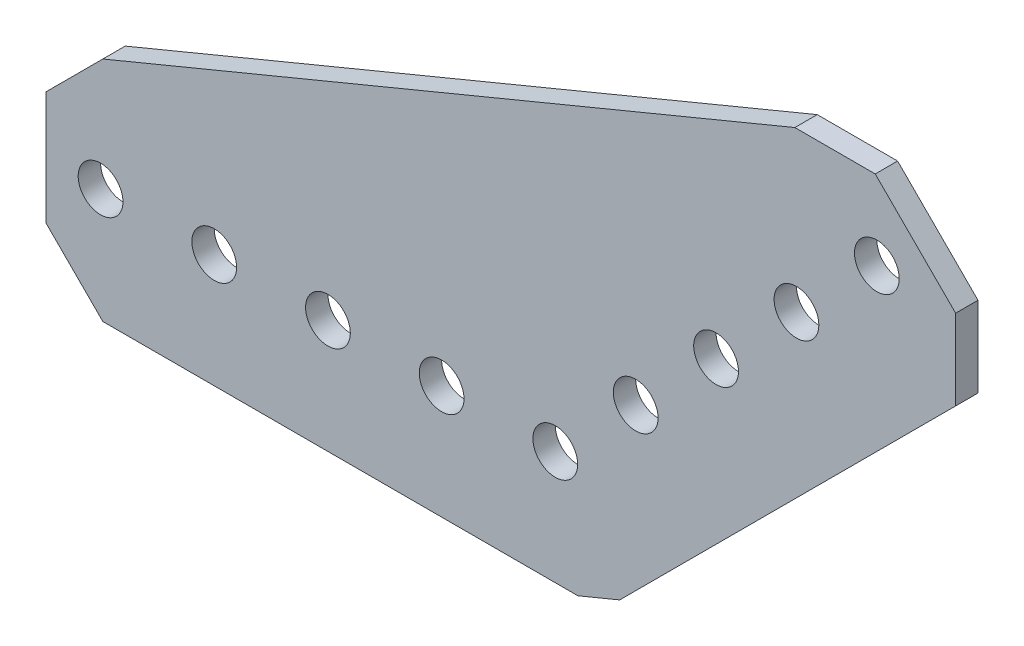
ISO-10303-21;
HEADER;
FILE_DESCRIPTION(('STEP AP214'),'2;1');
FILE_NAME('part.step','',(''),(''),'','','');
FILE_SCHEMA(('AUTOMOTIVE_DESIGN { 1 0 10303 214 1 1 1 1 }'));
ENDSEC;
DATA;
#1=APPLICATION_CONTEXT('core data for automotive mechanical design processes');
#2=APPLICATION_PROTOCOL_DEFINITION('international standard','automotive_design',2000,#1);
#3=PRODUCT_CONTEXT('',#1,'mechanical');
#4=PRODUCT('Part','Part','',(#3));
#5=PRODUCT_RELATED_PRODUCT_CATEGORY('part','',(#4));
#6=PRODUCT_DEFINITION_FORMATION('','',#4);
#7=PRODUCT_DEFINITION_CONTEXT('part definition',#1,'design');
#8=PRODUCT_DEFINITION('design','',#6,#7);
#9=PRODUCT_DEFINITION_SHAPE('','',#8);
#10=(LENGTH_UNIT() NAMED_UNIT(*) SI_UNIT(.MILLI.,.METRE.));
#11=(NAMED_UNIT(*) PLANE_ANGLE_UNIT() SI_UNIT($,.RADIAN.));
#12=(NAMED_UNIT(*) SI_UNIT($,.STERADIAN.) SOLID_ANGLE_UNIT());
#13=UNCERTAINTY_MEASURE_WITH_UNIT(LENGTH_MEASURE(1.E-05),#10,'distance_accuracy_value','');
#14=(GEOMETRIC_REPRESENTATION_CONTEXT(3) GLOBAL_UNCERTAINTY_ASSIGNED_CONTEXT((#13)) GLOBAL_UNIT_ASSIGNED_CONTEXT((#10,
#11,#12)) REPRESENTATION_CONTEXT('',''));
#15=CARTESIAN_POINT('',(0.,0.,0.));
#16=DIRECTION('',(0.,0.,1.));
#17=DIRECTION('',(1.,0.,0.));
#18=AXIS2_PLACEMENT_3D('',#15,#16,#17);
#19=CARTESIAN_POINT('',(-56.896,6.35,1.25));
#20=DIRECTION('',(-0.707106781186547,0.707106781186548,0.));
#21=DIRECTION('',(-0.707106781186548,-0.707106781186547,0.));
#22=AXIS2_PLACEMENT_3D('',#19,#20,#21);
#23=PLANE('',#22);
#24=DIRECTION('',(0.707106781186548,0.707106781186547,0.));
#25=VECTOR('',#24,1.);
#26=CARTESIAN_POINT('',(-56.896,6.35,-1.25));
#27=LINE('',#26,#25);
#28=CARTESIAN_POINT('',(-56.896,6.35,-1.25));
#29=VERTEX_POINT('',#28);
#30=CARTESIAN_POINT('',(-50.546,12.7,-1.25));
#31=VERTEX_POINT('',#30);
#32=EDGE_CURVE('E160',#29,#31,#27,.T.);
#33=ORIENTED_EDGE('',*,*,#32,.F.);
#34=DIRECTION('',(0.,0.,-1.));
#35=VECTOR('',#34,1.);
#36=CARTESIAN_POINT('',(-56.896,6.35,1.25));
#37=LINE('',#36,#35);
#38=CARTESIAN_POINT('',(-56.896,6.35,1.25));
#39=VERTEX_POINT('',#38);
#40=EDGE_CURVE('E11',#39,#29,#37,.T.);
#41=ORIENTED_EDGE('',*,*,#40,.F.);
#42=DIRECTION('',(0.707106781186548,0.707106781186547,0.));
#43=VECTOR('',#42,1.);
#44=CARTESIAN_POINT('',(-56.896,6.35,1.25));
#45=LINE('',#44,#43);
#46=CARTESIAN_POINT('',(-50.546,12.7,1.25));
#47=VERTEX_POINT('',#46);
#48=EDGE_CURVE('E197',#39,#47,#45,.T.);
#49=ORIENTED_EDGE('',*,*,#48,.T.);
#50=DIRECTION('',(0.,0.,-1.));
#51=VECTOR('',#50,1.);
#52=CARTESIAN_POINT('',(-50.546,12.7,1.25));
#53=LINE('',#52,#51);
#54=EDGE_CURVE('E48',#47,#31,#53,.T.);
#55=ORIENTED_EDGE('',*,*,#54,.T.);
#56=EDGE_LOOP('',(#33,#41,#49,#55));
#57=FACE_BOUND('',#56,.T.);
#58=ADVANCED_FACE('F45',(#57),#23,.T.);
#59=CARTESIAN_POINT('',(-56.896,-6.35,1.25));
#60=DIRECTION('',(-1.,0.,0.));
#61=DIRECTION('',(0.,0.,1.));
#62=AXIS2_PLACEMENT_3D('',#59,#60,#61);
#63=PLANE('',#62);
#64=DIRECTION('',(0.,1.,0.));
#65=VECTOR('',#64,1.);
#66=CARTESIAN_POINT('',(-56.896,-6.35,-1.25));
#67=LINE('',#66,#65);
#68=CARTESIAN_POINT('',(-56.896,-6.35,-1.25));
#69=VERTEX_POINT('',#68);
#70=EDGE_CURVE('E194',#69,#29,#67,.T.);
#71=ORIENTED_EDGE('',*,*,#70,.F.);
#72=DIRECTION('',(0.,0.,-1.));
#73=VECTOR('',#72,1.);
#74=CARTESIAN_POINT('',(-56.896,-6.35,1.25));
#75=LINE('',#74,#73);
#76=CARTESIAN_POINT('',(-56.896,-6.35,1.25));
#77=VERTEX_POINT('',#76);
#78=EDGE_CURVE('E55',#77,#69,#75,.T.);
#79=ORIENTED_EDGE('',*,*,#78,.F.);
#80=DIRECTION('',(0.,1.,0.));
#81=VECTOR('',#80,1.);
#82=CARTESIAN_POINT('',(-56.896,-6.35,1.25));
#83=LINE('',#82,#81);
#84=EDGE_CURVE('E146',#77,#39,#83,.T.);
#85=ORIENTED_EDGE('',*,*,#84,.T.);
#86=ORIENTED_EDGE('',*,*,#40,.T.);
#87=EDGE_LOOP('',(#71,#79,#85,#86));
#88=FACE_BOUND('',#87,.T.);
#89=ADVANCED_FACE('F221',(#88),#63,.T.);
#90=CARTESIAN_POINT('',(-50.546,-12.7,1.25));
#91=DIRECTION('',(-0.707106781186547,-0.707106781186548,0.));
#92=DIRECTION('',(0.707106781186548,-0.707106781186547,0.));
#93=AXIS2_PLACEMENT_3D('',#90,#91,#92);
#94=PLANE('',#93);
#95=DIRECTION('',(-0.707106781186548,0.707106781186547,0.));
#96=VECTOR('',#95,1.);
#97=CARTESIAN_POINT('',(-50.546,-12.7,-1.25));
#98=LINE('',#97,#96);
#99=CARTESIAN_POINT('',(-50.546,-12.7,-1.25));
#100=VERTEX_POINT('',#99);
#101=EDGE_CURVE('E132',#100,#69,#98,.T.);
#102=ORIENTED_EDGE('',*,*,#101,.F.);
#103=DIRECTION('',(0.,0.,-1.));
#104=VECTOR('',#103,1.);
#105=CARTESIAN_POINT('',(-50.546,-12.7,1.25));
#106=LINE('',#105,#104);
#107=CARTESIAN_POINT('',(-50.546,-12.7,1.25));
#108=VERTEX_POINT('',#107);
#109=EDGE_CURVE('E127',#108,#100,#106,.T.);
#110=ORIENTED_EDGE('',*,*,#109,.F.);
#111=DIRECTION('',(-0.707106781186548,0.707106781186547,0.));
#112=VECTOR('',#111,1.);
#113=CARTESIAN_POINT('',(-50.546,-12.7,1.25));
#114=LINE('',#113,#112);
#115=EDGE_CURVE('E130',#108,#77,#114,.T.);
#116=ORIENTED_EDGE('',*,*,#115,.T.);
#117=ORIENTED_EDGE('',*,*,#78,.T.);
#118=EDGE_LOOP('',(#102,#110,#116,#117));
#119=FACE_BOUND('',#118,.T.);
#120=ADVANCED_FACE('F129',(#119),#94,.T.);
#121=CARTESIAN_POINT('',(2.52618706572165,-12.7,1.25));
#122=DIRECTION('',(0.,-1.,0.));
#123=DIRECTION('',(0.,0.,-1.));
#124=AXIS2_PLACEMENT_3D('',#121,#122,#123);
#125=PLANE('',#124);
#126=DIRECTION('',(-1.,0.,0.));
#127=VECTOR('',#126,1.);
#128=CARTESIAN_POINT('',(2.52618706572165,-12.7,-1.25));
#129=LINE('',#128,#127);
#130=CARTESIAN_POINT('',(2.52618706572165,-12.7,-1.25));
#131=VERTEX_POINT('',#130);
#132=EDGE_CURVE('E189',#131,#100,#129,.T.);
#133=ORIENTED_EDGE('',*,*,#132,.F.);
#134=DIRECTION('',(0.,0.,-1.));
#135=VECTOR('',#134,1.);
#136=CARTESIAN_POINT('',(2.52618706572165,-12.7,1.25));
#137=LINE('',#136,#135);
#138=CARTESIAN_POINT('',(2.52618706572165,-12.7,1.25));
#139=VERTEX_POINT('',#138);
#140=EDGE_CURVE('E138',#139,#131,#137,.T.);
#141=ORIENTED_EDGE('',*,*,#140,.F.);
#142=DIRECTION('',(-1.,0.,0.));
#143=VECTOR('',#142,1.);
#144=CARTESIAN_POINT('',(2.52618706572165,-12.7,1.25));
#145=LINE('',#144,#143);
#146=EDGE_CURVE('E144',#139,#108,#145,.T.);
#147=ORIENTED_EDGE('',*,*,#146,.T.);
#148=ORIENTED_EDGE('',*,*,#109,.T.);
#149=EDGE_LOOP('',(#133,#141,#147,#148));
#150=FACE_BOUND('',#149,.T.);
#151=ADVANCED_FACE('F149',(#150),#125,.T.);
#152=CARTESIAN_POINT('',(7.19397211635163,-10.7665401257867,1.25));
#153=DIRECTION('',(0.38268343236509,-0.923879532511287,0.));
#154=DIRECTION('',(0.923879532511287,0.38268343236509,0.));
#155=AXIS2_PLACEMENT_3D('',#152,#153,#154);
#156=PLANE('',#155);
#157=DIRECTION('',(-0.923879532511287,-0.38268343236509,0.));
#158=VECTOR('',#157,1.);
#159=CARTESIAN_POINT('',(7.19397211635163,-10.7665401257867,-1.25));
#160=LINE('',#159,#158);
#161=CARTESIAN_POINT('',(7.19397211635163,-10.7665401257867,-1.25));
#162=VERTEX_POINT('',#161);
#163=EDGE_CURVE('E185',#162,#131,#160,.T.);
#164=ORIENTED_EDGE('',*,*,#163,.F.);
#165=DIRECTION('',(0.,0.,-1.));
#166=VECTOR('',#165,1.);
#167=CARTESIAN_POINT('',(7.19397211635163,-10.7665401257867,1.25));
#168=LINE('',#167,#166);
#169=CARTESIAN_POINT('',(7.19397211635163,-10.7665401257867,1.25));
#170=VERTEX_POINT('',#169);
#171=EDGE_CURVE('E203',#170,#162,#168,.T.);
#172=ORIENTED_EDGE('',*,*,#171,.F.);
#173=DIRECTION('',(-0.923879532511287,-0.38268343236509,0.));
#174=VECTOR('',#173,1.);
#175=CARTESIAN_POINT('',(7.19397211635163,-10.7665401257867,1.25));
#176=LINE('',#175,#174);
#177=EDGE_CURVE('E151',#170,#139,#176,.T.);
#178=ORIENTED_EDGE('',*,*,#177,.T.);
#179=ORIENTED_EDGE('',*,*,#140,.T.);
#180=EDGE_LOOP('',(#164,#172,#178,#179));
#181=FACE_BOUND('',#180,.T.);
#182=ADVANCED_FACE('F234',(#181),#156,.T.);
#183=CARTESIAN_POINT('',(44.7216754829243,26.7611632407862,1.25));
#184=DIRECTION('',(0.707106781186549,-0.707106781186546,0.));
#185=DIRECTION('',(0.707106781186546,0.707106781186549,0.));
#186=AXIS2_PLACEMENT_3D('',#183,#184,#185);
#187=PLANE('',#186);
#188=DIRECTION('',(-0.707106781186546,-0.707106781186549,0.));
#189=VECTOR('',#188,1.);
#190=CARTESIAN_POINT('',(44.7216754829243,26.7611632407862,-1.25));
#191=LINE('',#190,#189);
#192=CARTESIAN_POINT('',(44.7216754829243,26.7611632407862,-1.25));
#193=VERTEX_POINT('',#192);
#194=EDGE_CURVE('E181',#193,#162,#191,.T.);
#195=ORIENTED_EDGE('',*,*,#194,.F.);
#196=DIRECTION('',(0.,0.,-1.));
#197=VECTOR('',#196,1.);
#198=CARTESIAN_POINT('',(44.7216754829243,26.7611632407862,1.25));
#199=LINE('',#198,#197);
#200=CARTESIAN_POINT('',(44.7216754829243,26.7611632407862,1.25));
#201=VERTEX_POINT('',#200);
#202=EDGE_CURVE('E206',#201,#193,#199,.T.);
#203=ORIENTED_EDGE('',*,*,#202,.F.);
#204=DIRECTION('',(-0.707106781186546,-0.707106781186549,0.));
#205=VECTOR('',#204,1.);
#206=CARTESIAN_POINT('',(44.7216754829243,26.7611632407862,1.25));
#207=LINE('',#206,#205);
#208=EDGE_CURVE('E154',#201,#170,#207,.T.);
#209=ORIENTED_EDGE('',*,*,#208,.T.);
#210=ORIENTED_EDGE('',*,*,#171,.T.);
#211=EDGE_LOOP('',(#195,#203,#209,#210));
#212=FACE_BOUND('',#211,.T.);
#213=ADVANCED_FACE('F237',(#212),#187,.T.);
#214=CARTESIAN_POINT('',(44.7216754829243,35.7414193618553,1.25));
#215=DIRECTION('',(1.,0.,0.));
#216=DIRECTION('',(0.,1.,0.));
#217=AXIS2_PLACEMENT_3D('',#214,#215,#216);
#218=PLANE('',#217);
#219=DIRECTION('',(0.,-1.,0.));
#220=VECTOR('',#219,1.);
#221=CARTESIAN_POINT('',(44.7216754829243,35.7414193618553,-1.25));
#222=LINE('',#221,#220);
#223=CARTESIAN_POINT('',(44.7216754829243,35.7414193618553,-1.25));
#224=VERTEX_POINT('',#223);
#225=EDGE_CURVE('E177',#224,#193,#222,.T.);
#226=ORIENTED_EDGE('',*,*,#225,.F.);
#227=DIRECTION('',(0.,0.,-1.));
#228=VECTOR('',#227,1.);
#229=CARTESIAN_POINT('',(44.7216754829243,35.7414193618553,1.25));
#230=LINE('',#229,#228);
#231=CARTESIAN_POINT('',(44.7216754829243,35.7414193618553,1.25));
#232=VERTEX_POINT('',#231);
#233=EDGE_CURVE('E209',#232,#224,#230,.T.);
#234=ORIENTED_EDGE('',*,*,#233,.F.);
#235=DIRECTION('',(0.,-1.,0.));
#236=VECTOR('',#235,1.);
#237=CARTESIAN_POINT('',(44.7216754829243,35.7414193618553,1.25));
#238=LINE('',#237,#236);
#239=EDGE_CURVE('E389',#232,#201,#238,.T.);
#240=ORIENTED_EDGE('',*,*,#239,.T.);
#241=ORIENTED_EDGE('',*,*,#202,.T.);
#242=EDGE_LOOP('',(#226,#234,#240,#241));
#243=FACE_BOUND('',#242,.T.);
#244=ADVANCED_FACE('F241',(#243),#218,.T.);
#245=CARTESIAN_POINT('',(35.7414193618552,44.7216754829245,1.25));
#246=DIRECTION('',(0.70710678118655,0.707106781186545,0.));
#247=DIRECTION('',(-0.707106781186545,0.70710678118655,0.));
#248=AXIS2_PLACEMENT_3D('',#245,#246,#247);
#249=PLANE('',#248);
#250=DIRECTION('',(0.707106781186545,-0.70710678118655,0.));
#251=VECTOR('',#250,1.);
#252=CARTESIAN_POINT('',(35.7414193618552,44.7216754829245,-1.25));
#253=LINE('',#252,#251);
#254=CARTESIAN_POINT('',(35.7414193618552,44.7216754829245,-1.25));
#255=VERTEX_POINT('',#254);
#256=EDGE_CURVE('E173',#255,#224,#253,.T.);
#257=ORIENTED_EDGE('',*,*,#256,.F.);
#258=DIRECTION('',(0.,0.,-1.));
#259=VECTOR('',#258,1.);
#260=CARTESIAN_POINT('',(35.7414193618552,44.7216754829245,1.25));
#261=LINE('',#260,#259);
#262=CARTESIAN_POINT('',(35.7414193618552,44.7216754829245,1.25));
#263=VERTEX_POINT('',#262);
#264=EDGE_CURVE('E212',#263,#255,#261,.T.);
#265=ORIENTED_EDGE('',*,*,#264,.F.);
#266=DIRECTION('',(0.707106781186545,-0.70710678118655,0.));
#267=VECTOR('',#266,1.);
#268=CARTESIAN_POINT('',(35.7414193618552,44.7216754829245,1.25));
#269=LINE('',#268,#267);
#270=EDGE_CURVE('E385',#263,#232,#269,.T.);
#271=ORIENTED_EDGE('',*,*,#270,.T.);
#272=ORIENTED_EDGE('',*,*,#233,.T.);
#273=EDGE_LOOP('',(#257,#265,#271,#272));
#274=FACE_BOUND('',#273,.T.);
#275=ADVANCED_FACE('F245',(#274),#249,.T.);
#276=CARTESIAN_POINT('',(26.7611632407861,44.7216754829245,1.25));
#277=DIRECTION('',(0.,1.,0.));
#278=DIRECTION('',(0.,0.,1.));
#279=AXIS2_PLACEMENT_3D('',#276,#277,#278);
#280=PLANE('',#279);
#281=DIRECTION('',(1.,0.,0.));
#282=VECTOR('',#281,1.);
#283=CARTESIAN_POINT('',(26.7611632407861,44.7216754829245,-1.25));
#284=LINE('',#283,#282);
#285=CARTESIAN_POINT('',(26.7611632407861,44.7216754829245,-1.25));
#286=VERTEX_POINT('',#285);
#287=EDGE_CURVE('E169',#286,#255,#284,.T.);
#288=ORIENTED_EDGE('',*,*,#287,.F.);
#289=DIRECTION('',(0.,0.,-1.));
#290=VECTOR('',#289,1.);
#291=CARTESIAN_POINT('',(26.7611632407861,44.7216754829245,1.25));
#292=LINE('',#291,#290);
#293=CARTESIAN_POINT('',(26.7611632407861,44.7216754829245,1.25));
#294=VERTEX_POINT('',#293);
#295=EDGE_CURVE('E214',#294,#286,#292,.T.);
#296=ORIENTED_EDGE('',*,*,#295,.F.);
#297=DIRECTION('',(1.,0.,0.));
#298=VECTOR('',#297,1.);
#299=CARTESIAN_POINT('',(26.7611632407861,44.7216754829245,1.25));
#300=LINE('',#299,#298);
#301=EDGE_CURVE('E381',#294,#263,#300,.T.);
#302=ORIENTED_EDGE('',*,*,#301,.T.);
#303=ORIENTED_EDGE('',*,*,#264,.T.);
#304=EDGE_LOOP('',(#288,#296,#302,#303));
#305=FACE_BOUND('',#304,.T.);
#306=ADVANCED_FACE('F249',(#305),#280,.T.);
#307=CARTESIAN_POINT('',(-50.546,12.7,1.25));
#308=DIRECTION('',(-0.382683432365091,0.923879532511287,0.));
#309=DIRECTION('',(-0.923879532511287,-0.382683432365091,0.));
#310=AXIS2_PLACEMENT_3D('',#307,#308,#309);
#311=PLANE('',#310);
#312=DIRECTION('',(0.923879532511287,0.382683432365091,0.));
#313=VECTOR('',#312,1.);
#314=CARTESIAN_POINT('',(-50.546,12.7,-1.25));
#315=LINE('',#314,#313);
#316=EDGE_CURVE('E164',#31,#286,#315,.T.);
#317=ORIENTED_EDGE('',*,*,#316,.F.);
#318=ORIENTED_EDGE('',*,*,#54,.F.);
#319=DIRECTION('',(0.923879532511287,0.382683432365091,0.));
#320=VECTOR('',#319,1.);
#321=CARTESIAN_POINT('',(-50.546,12.7,1.25));
#322=LINE('',#321,#320);
#323=EDGE_CURVE('E378',#47,#294,#322,.T.);
#324=ORIENTED_EDGE('',*,*,#323,.T.);
#325=ORIENTED_EDGE('',*,*,#295,.T.);
#326=EDGE_LOOP('',(#317,#318,#324,#325));
#327=FACE_BOUND('',#326,.T.);
#328=ADVANCED_FACE('F218',(#327),#311,.T.);
#329=CARTESIAN_POINT('',(0.,0.,1.25));
#330=DIRECTION('',(0.,0.,-1.));
#331=DIRECTION('',(-1.,0.,0.));
#332=AXIS2_PLACEMENT_3D('',#329,#330,#331);
#333=PLANE('',#332);
#334=CARTESIAN_POINT('',(8.9802561210692,8.98025612106911,1.25));
#335=DIRECTION('',(0.,0.,-1.));
#336=DIRECTION('',(1.,0.,0.));
#337=AXIS2_PLACEMENT_3D('',#334,#335,#336);
#338=CIRCLE('',#337,2.5);
#339=CARTESIAN_POINT('',(11.4802561210692,8.98025612106911,1.25));
#340=VERTEX_POINT('',#339);
#341=EDGE_CURVE('E304',#340,#340,#338,.T.);
#342=ORIENTED_EDGE('',*,*,#341,.T.);
#343=EDGE_LOOP('',(#342));
#344=FACE_BOUND('',#343,.T.);
#345=CARTESIAN_POINT('',(17.9605122421383,17.9605122421383,1.25));
#346=DIRECTION('',(0.,0.,-1.));
#347=DIRECTION('',(1.,0.,0.));
#348=AXIS2_PLACEMENT_3D('',#345,#346,#347);
#349=CIRCLE('',#348,2.5);
#350=CARTESIAN_POINT('',(20.4605122421383,17.9605122421383,1.25));
#351=VERTEX_POINT('',#350);
#352=EDGE_CURVE('E314',#351,#351,#349,.T.);
#353=ORIENTED_EDGE('',*,*,#352,.T.);
#354=EDGE_LOOP('',(#353));
#355=FACE_BOUND('',#354,.T.);
#356=CARTESIAN_POINT('',(26.9407683632075,26.9407683632075,1.25));
#357=DIRECTION('',(0.,0.,-1.));
#358=DIRECTION('',(1.,0.,0.));
#359=AXIS2_PLACEMENT_3D('',#356,#357,#358);
#360=CIRCLE('',#359,2.5);
#361=CARTESIAN_POINT('',(29.4407683632075,26.9407683632075,1.25));
#362=VERTEX_POINT('',#361);
#363=EDGE_CURVE('E322',#362,#362,#360,.T.);
#364=ORIENTED_EDGE('',*,*,#363,.T.);
#365=EDGE_LOOP('',(#364));
#366=FACE_BOUND('',#365,.T.);
#367=CARTESIAN_POINT('',(35.9210244842766,35.9210244842766,1.25));
#368=DIRECTION('',(0.,0.,-1.));
#369=DIRECTION('',(1.,0.,0.));
#370=AXIS2_PLACEMENT_3D('',#367,#368,#369);
#371=CIRCLE('',#370,2.5);
#372=CARTESIAN_POINT('',(38.4210244842766,35.9210244842766,1.25));
#373=VERTEX_POINT('',#372);
#374=EDGE_CURVE('E330',#373,#373,#371,.T.);
#375=ORIENTED_EDGE('',*,*,#374,.T.);
#376=EDGE_LOOP('',(#375));
#377=FACE_BOUND('',#376,.T.);
#378=CARTESIAN_POINT('',(-38.1,0.,1.25));
#379=DIRECTION('',(0.,0.,-1.));
#380=DIRECTION('',(1.,0.,0.));
#381=AXIS2_PLACEMENT_3D('',#378,#379,#380);
#382=CIRCLE('',#381,2.5);
#383=CARTESIAN_POINT('',(-35.6,0.,1.25));
#384=VERTEX_POINT('',#383);
#385=EDGE_CURVE('E338',#384,#384,#382,.T.);
#386=ORIENTED_EDGE('',*,*,#385,.T.);
#387=EDGE_LOOP('',(#386));
#388=FACE_BOUND('',#387,.T.);
#389=CARTESIAN_POINT('',(-50.8,0.,1.25));
#390=DIRECTION('',(0.,0.,-1.));
#391=DIRECTION('',(1.,0.,0.));
#392=AXIS2_PLACEMENT_3D('',#389,#390,#391);
#393=CIRCLE('',#392,2.5);
#394=CARTESIAN_POINT('',(-48.3,0.,1.25));
#395=VERTEX_POINT('',#394);
#396=EDGE_CURVE('E346',#395,#395,#393,.T.);
#397=ORIENTED_EDGE('',*,*,#396,.T.);
#398=EDGE_LOOP('',(#397));
#399=FACE_BOUND('',#398,.T.);
#400=CARTESIAN_POINT('',(0.,0.,1.25));
#401=DIRECTION('',(0.,0.,-1.));
#402=DIRECTION('',(1.,0.,0.));
#403=AXIS2_PLACEMENT_3D('',#400,#401,#402);
#404=CIRCLE('',#403,2.5);
#405=CARTESIAN_POINT('',(2.5,0.,1.25));
#406=VERTEX_POINT('',#405);
#407=EDGE_CURVE('E354',#406,#406,#404,.T.);
#408=ORIENTED_EDGE('',*,*,#407,.T.);
#409=EDGE_LOOP('',(#408));
#410=FACE_BOUND('',#409,.T.);
#411=CARTESIAN_POINT('',(-25.4,0.,1.25));
#412=DIRECTION('',(0.,0.,-1.));
#413=DIRECTION('',(1.,0.,0.));
#414=AXIS2_PLACEMENT_3D('',#411,#412,#413);
#415=CIRCLE('',#414,2.5);
#416=CARTESIAN_POINT('',(-22.9,0.,1.25));
#417=VERTEX_POINT('',#416);
#418=EDGE_CURVE('E362',#417,#417,#415,.T.);
#419=ORIENTED_EDGE('',*,*,#418,.T.);
#420=EDGE_LOOP('',(#419));
#421=FACE_BOUND('',#420,.T.);
#422=CARTESIAN_POINT('',(-12.7,0.,1.25));
#423=DIRECTION('',(0.,0.,-1.));
#424=DIRECTION('',(1.,0.,0.));
#425=AXIS2_PLACEMENT_3D('',#422,#423,#424);
#426=CIRCLE('',#425,2.5);
#427=CARTESIAN_POINT('',(-10.2,0.,1.25));
#428=VERTEX_POINT('',#427);
#429=EDGE_CURVE('E165',#428,#428,#426,.T.);
#430=ORIENTED_EDGE('',*,*,#429,.T.);
#431=EDGE_LOOP('',(#430));
#432=FACE_BOUND('',#431,.T.);
#433=ORIENTED_EDGE('',*,*,#48,.F.);
#434=ORIENTED_EDGE('',*,*,#84,.F.);
#435=ORIENTED_EDGE('',*,*,#115,.F.);
#436=ORIENTED_EDGE('',*,*,#146,.F.);
#437=ORIENTED_EDGE('',*,*,#177,.F.);
#438=ORIENTED_EDGE('',*,*,#208,.F.);
#439=ORIENTED_EDGE('',*,*,#239,.F.);
#440=ORIENTED_EDGE('',*,*,#270,.F.);
#441=ORIENTED_EDGE('',*,*,#301,.F.);
#442=ORIENTED_EDGE('',*,*,#323,.F.);
#443=EDGE_LOOP('',(#433,#434,#435,#436,#437,#438,#439,#440,#441,#442));
#444=FACE_BOUND('',#443,.T.);
#445=ADVANCED_FACE('F142',(#344,#355,#366,#377,#388,#399,#410,#421,#432,#444),#333,.F.);
#446=CARTESIAN_POINT('',(0.,0.,-1.25));
#447=DIRECTION('',(0.,0.,-1.));
#448=DIRECTION('',(-1.,0.,0.));
#449=AXIS2_PLACEMENT_3D('',#446,#447,#448);
#450=PLANE('',#449);
#451=CARTESIAN_POINT('',(8.9802561210692,8.98025612106911,-1.25));
#452=DIRECTION('',(0.,0.,-1.));
#453=DIRECTION('',(1.,0.,0.));
#454=AXIS2_PLACEMENT_3D('',#451,#452,#453);
#455=CIRCLE('',#454,2.5);
#456=CARTESIAN_POINT('',(11.4802561210692,8.98025612106911,-1.25));
#457=VERTEX_POINT('',#456);
#458=EDGE_CURVE('E307',#457,#457,#455,.T.);
#459=ORIENTED_EDGE('',*,*,#458,.F.);
#460=EDGE_LOOP('',(#459));
#461=FACE_BOUND('',#460,.T.);
#462=CARTESIAN_POINT('',(17.9605122421383,17.9605122421383,-1.25));
#463=DIRECTION('',(0.,0.,-1.));
#464=DIRECTION('',(1.,0.,0.));
#465=AXIS2_PLACEMENT_3D('',#462,#463,#464);
#466=CIRCLE('',#465,2.5);
#467=CARTESIAN_POINT('',(20.4605122421383,17.9605122421383,-1.25));
#468=VERTEX_POINT('',#467);
#469=EDGE_CURVE('E311',#468,#468,#466,.T.);
#470=ORIENTED_EDGE('',*,*,#469,.F.);
#471=EDGE_LOOP('',(#470));
#472=FACE_BOUND('',#471,.T.);
#473=CARTESIAN_POINT('',(26.9407683632075,26.9407683632075,-1.25));
#474=DIRECTION('',(0.,0.,-1.));
#475=DIRECTION('',(1.,0.,0.));
#476=AXIS2_PLACEMENT_3D('',#473,#474,#475);
#477=CIRCLE('',#476,2.5);
#478=CARTESIAN_POINT('',(29.4407683632075,26.9407683632075,-1.25));
#479=VERTEX_POINT('',#478);
#480=EDGE_CURVE('E318',#479,#479,#477,.T.);
#481=ORIENTED_EDGE('',*,*,#480,.F.);
#482=EDGE_LOOP('',(#481));
#483=FACE_BOUND('',#482,.T.);
#484=CARTESIAN_POINT('',(35.9210244842766,35.9210244842766,-1.25));
#485=DIRECTION('',(0.,0.,-1.));
#486=DIRECTION('',(1.,0.,0.));
#487=AXIS2_PLACEMENT_3D('',#484,#485,#486);
#488=CIRCLE('',#487,2.5);
#489=CARTESIAN_POINT('',(38.4210244842766,35.9210244842766,-1.25));
#490=VERTEX_POINT('',#489);
#491=EDGE_CURVE('E326',#490,#490,#488,.T.);
#492=ORIENTED_EDGE('',*,*,#491,.F.);
#493=EDGE_LOOP('',(#492));
#494=FACE_BOUND('',#493,.T.);
#495=CARTESIAN_POINT('',(-38.1,0.,-1.25));
#496=DIRECTION('',(0.,0.,-1.));
#497=DIRECTION('',(1.,0.,0.));
#498=AXIS2_PLACEMENT_3D('',#495,#496,#497);
#499=CIRCLE('',#498,2.5);
#500=CARTESIAN_POINT('',(-35.6,0.,-1.25));
#501=VERTEX_POINT('',#500);
#502=EDGE_CURVE('E334',#501,#501,#499,.T.);
#503=ORIENTED_EDGE('',*,*,#502,.F.);
#504=EDGE_LOOP('',(#503));
#505=FACE_BOUND('',#504,.T.);
#506=CARTESIAN_POINT('',(-50.8,0.,-1.25));
#507=DIRECTION('',(0.,0.,-1.));
#508=DIRECTION('',(1.,0.,0.));
#509=AXIS2_PLACEMENT_3D('',#506,#507,#508);
#510=CIRCLE('',#509,2.5);
#511=CARTESIAN_POINT('',(-48.3,0.,-1.25));
#512=VERTEX_POINT('',#511);
#513=EDGE_CURVE('E342',#512,#512,#510,.T.);
#514=ORIENTED_EDGE('',*,*,#513,.F.);
#515=EDGE_LOOP('',(#514));
#516=FACE_BOUND('',#515,.T.);
#517=CARTESIAN_POINT('',(0.,0.,-1.25));
#518=DIRECTION('',(0.,0.,-1.));
#519=DIRECTION('',(1.,0.,0.));
#520=AXIS2_PLACEMENT_3D('',#517,#518,#519);
#521=CIRCLE('',#520,2.5);
#522=CARTESIAN_POINT('',(2.5,0.,-1.25));
#523=VERTEX_POINT('',#522);
#524=EDGE_CURVE('E350',#523,#523,#521,.T.);
#525=ORIENTED_EDGE('',*,*,#524,.F.);
#526=EDGE_LOOP('',(#525));
#527=FACE_BOUND('',#526,.T.);
#528=CARTESIAN_POINT('',(-25.4,0.,-1.25));
#529=DIRECTION('',(0.,0.,-1.));
#530=DIRECTION('',(1.,0.,0.));
#531=AXIS2_PLACEMENT_3D('',#528,#529,#530);
#532=CIRCLE('',#531,2.5);
#533=CARTESIAN_POINT('',(-22.9,0.,-1.25));
#534=VERTEX_POINT('',#533);
#535=EDGE_CURVE('E358',#534,#534,#532,.T.);
#536=ORIENTED_EDGE('',*,*,#535,.F.);
#537=EDGE_LOOP('',(#536));
#538=FACE_BOUND('',#537,.T.);
#539=CARTESIAN_POINT('',(-12.7,0.,-1.25));
#540=DIRECTION('',(0.,0.,-1.));
#541=DIRECTION('',(1.,0.,0.));
#542=AXIS2_PLACEMENT_3D('',#539,#540,#541);
#543=CIRCLE('',#542,2.5);
#544=CARTESIAN_POINT('',(-10.2,0.,-1.25));
#545=VERTEX_POINT('',#544);
#546=EDGE_CURVE('E366',#545,#545,#543,.T.);
#547=ORIENTED_EDGE('',*,*,#546,.F.);
#548=EDGE_LOOP('',(#547));
#549=FACE_BOUND('',#548,.T.);
#550=ORIENTED_EDGE('',*,*,#32,.T.);
#551=ORIENTED_EDGE('',*,*,#316,.T.);
#552=ORIENTED_EDGE('',*,*,#287,.T.);
#553=ORIENTED_EDGE('',*,*,#256,.T.);
#554=ORIENTED_EDGE('',*,*,#225,.T.);
#555=ORIENTED_EDGE('',*,*,#194,.T.);
#556=ORIENTED_EDGE('',*,*,#163,.T.);
#557=ORIENTED_EDGE('',*,*,#132,.T.);
#558=ORIENTED_EDGE('',*,*,#101,.T.);
#559=ORIENTED_EDGE('',*,*,#70,.T.);
#560=EDGE_LOOP('',(#550,#551,#552,#553,#554,#555,#556,#557,#558,#559));
#561=FACE_BOUND('',#560,.T.);
#562=ADVANCED_FACE('F220',(#461,#472,#483,#494,#505,#516,#527,#538,#549,#561),#450,.T.);
#563=CARTESIAN_POINT('',(-12.7,0.,1.25));
#564=DIRECTION('',(0.,0.,-1.));
#565=DIRECTION('',(-1.,0.,0.));
#566=AXIS2_PLACEMENT_3D('',#563,#564,#565);
#567=CYLINDRICAL_SURFACE('',#566,2.5);
#568=ORIENTED_EDGE('',*,*,#429,.F.);
#569=EDGE_LOOP('',(#568));
#570=FACE_BOUND('',#569,.T.);
#571=ORIENTED_EDGE('',*,*,#546,.T.);
#572=EDGE_LOOP('',(#571));
#573=FACE_BOUND('',#572,.T.);
#574=ADVANCED_FACE('F261',(#570,#573),#567,.F.);
#575=CARTESIAN_POINT('',(-25.4,0.,1.25));
#576=DIRECTION('',(0.,0.,-1.));
#577=DIRECTION('',(-1.,0.,0.));
#578=AXIS2_PLACEMENT_3D('',#575,#576,#577);
#579=CYLINDRICAL_SURFACE('',#578,2.5);
#580=ORIENTED_EDGE('',*,*,#418,.F.);
#581=EDGE_LOOP('',(#580));
#582=FACE_BOUND('',#581,.T.);
#583=ORIENTED_EDGE('',*,*,#535,.T.);
#584=EDGE_LOOP('',(#583));
#585=FACE_BOUND('',#584,.T.);
#586=ADVANCED_FACE('F268',(#582,#585),#579,.F.);
#587=CARTESIAN_POINT('',(0.,0.,1.25));
#588=DIRECTION('',(0.,0.,-1.));
#589=DIRECTION('',(-1.,0.,0.));
#590=AXIS2_PLACEMENT_3D('',#587,#588,#589);
#591=CYLINDRICAL_SURFACE('',#590,2.5);
#592=ORIENTED_EDGE('',*,*,#407,.F.);
#593=EDGE_LOOP('',(#592));
#594=FACE_BOUND('',#593,.T.);
#595=ORIENTED_EDGE('',*,*,#524,.T.);
#596=EDGE_LOOP('',(#595));
#597=FACE_BOUND('',#596,.T.);
#598=ADVANCED_FACE('F272',(#594,#597),#591,.F.);
#599=CARTESIAN_POINT('',(-50.8,0.,1.25));
#600=DIRECTION('',(0.,0.,-1.));
#601=DIRECTION('',(-1.,0.,0.));
#602=AXIS2_PLACEMENT_3D('',#599,#600,#601);
#603=CYLINDRICAL_SURFACE('',#602,2.5);
#604=ORIENTED_EDGE('',*,*,#396,.F.);
#605=EDGE_LOOP('',(#604));
#606=FACE_BOUND('',#605,.T.);
#607=ORIENTED_EDGE('',*,*,#513,.T.);
#608=EDGE_LOOP('',(#607));
#609=FACE_BOUND('',#608,.T.);
#610=ADVANCED_FACE('F276',(#606,#609),#603,.F.);
#611=CARTESIAN_POINT('',(-38.1,0.,1.25));
#612=DIRECTION('',(0.,0.,-1.));
#613=DIRECTION('',(-1.,0.,0.));
#614=AXIS2_PLACEMENT_3D('',#611,#612,#613);
#615=CYLINDRICAL_SURFACE('',#614,2.5);
#616=ORIENTED_EDGE('',*,*,#385,.F.);
#617=EDGE_LOOP('',(#616));
#618=FACE_BOUND('',#617,.T.);
#619=ORIENTED_EDGE('',*,*,#502,.T.);
#620=EDGE_LOOP('',(#619));
#621=FACE_BOUND('',#620,.T.);
#622=ADVANCED_FACE('F280',(#618,#621),#615,.F.);
#623=CARTESIAN_POINT('',(35.9210244842766,35.9210244842766,1.25));
#624=DIRECTION('',(0.,0.,-1.));
#625=DIRECTION('',(-1.,0.,0.));
#626=AXIS2_PLACEMENT_3D('',#623,#624,#625);
#627=CYLINDRICAL_SURFACE('',#626,2.5);
#628=ORIENTED_EDGE('',*,*,#374,.F.);
#629=EDGE_LOOP('',(#628));
#630=FACE_BOUND('',#629,.T.);
#631=ORIENTED_EDGE('',*,*,#491,.T.);
#632=EDGE_LOOP('',(#631));
#633=FACE_BOUND('',#632,.T.);
#634=ADVANCED_FACE('F284',(#630,#633),#627,.F.);
#635=CARTESIAN_POINT('',(26.9407683632075,26.9407683632075,1.25));
#636=DIRECTION('',(0.,0.,-1.));
#637=DIRECTION('',(-1.,0.,0.));
#638=AXIS2_PLACEMENT_3D('',#635,#636,#637);
#639=CYLINDRICAL_SURFACE('',#638,2.5);
#640=ORIENTED_EDGE('',*,*,#363,.F.);
#641=EDGE_LOOP('',(#640));
#642=FACE_BOUND('',#641,.T.);
#643=ORIENTED_EDGE('',*,*,#480,.T.);
#644=EDGE_LOOP('',(#643));
#645=FACE_BOUND('',#644,.T.);
#646=ADVANCED_FACE('F288',(#642,#645),#639,.F.);
#647=CARTESIAN_POINT('',(17.9605122421383,17.9605122421383,1.25));
#648=DIRECTION('',(0.,0.,-1.));
#649=DIRECTION('',(-1.,0.,0.));
#650=AXIS2_PLACEMENT_3D('',#647,#648,#649);
#651=CYLINDRICAL_SURFACE('',#650,2.5);
#652=ORIENTED_EDGE('',*,*,#352,.F.);
#653=EDGE_LOOP('',(#652));
#654=FACE_BOUND('',#653,.T.);
#655=ORIENTED_EDGE('',*,*,#469,.T.);
#656=EDGE_LOOP('',(#655));
#657=FACE_BOUND('',#656,.T.);
#658=ADVANCED_FACE('F292',(#654,#657),#651,.F.);
#659=CARTESIAN_POINT('',(8.9802561210692,8.98025612106911,1.25));
#660=DIRECTION('',(0.,0.,-1.));
#661=DIRECTION('',(-1.,0.,0.));
#662=AXIS2_PLACEMENT_3D('',#659,#660,#661);
#663=CYLINDRICAL_SURFACE('',#662,2.5);
#664=ORIENTED_EDGE('',*,*,#341,.F.);
#665=EDGE_LOOP('',(#664));
#666=FACE_BOUND('',#665,.T.);
#667=ORIENTED_EDGE('',*,*,#458,.T.);
#668=EDGE_LOOP('',(#667));
#669=FACE_BOUND('',#668,.T.);
#670=ADVANCED_FACE('F296',(#666,#669),#663,.F.);
#671=CLOSED_SHELL('',(#58,#89,#120,#151,#182,#213,#244,#275,#306,#328,#445,#562,#574,#586,#598,
#610,#622,#634,#646,#658,#670));
#672=MANIFOLD_SOLID_BREP('B2',#671);
#673=ADVANCED_BREP_SHAPE_REPRESENTATION('',(#18,#672),#14);
#674=SHAPE_DEFINITION_REPRESENTATION(#9,#673);
ENDSEC;
END-ISO-10303-21;
